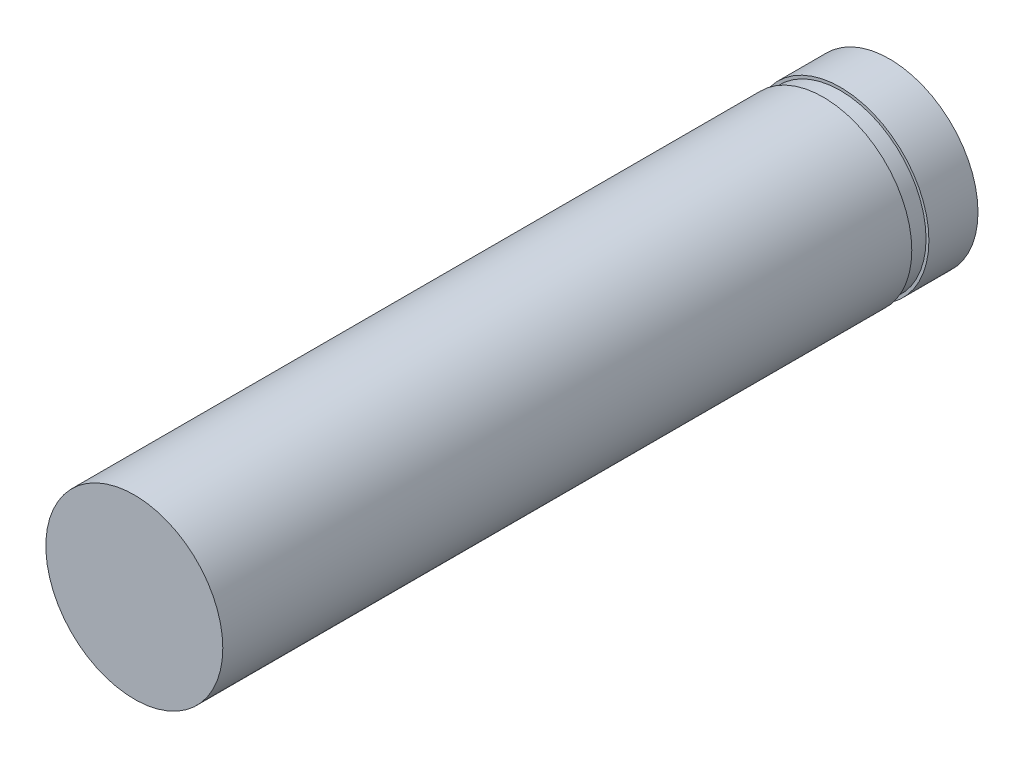
ISO-10303-21;
HEADER;
FILE_DESCRIPTION(('STEP AP214'),'2;1');
FILE_NAME('part.step','',(''),(''),'','','');
FILE_SCHEMA(('AUTOMOTIVE_DESIGN { 1 0 10303 214 1 1 1 1 }'));
ENDSEC;
DATA;
#1=APPLICATION_CONTEXT('core data for automotive mechanical design processes');
#2=APPLICATION_PROTOCOL_DEFINITION('international standard','automotive_design',2000,#1);
#3=PRODUCT_CONTEXT('',#1,'mechanical');
#4=PRODUCT('Part','Part','',(#3));
#5=PRODUCT_RELATED_PRODUCT_CATEGORY('part','',(#4));
#6=PRODUCT_DEFINITION_FORMATION('','',#4);
#7=PRODUCT_DEFINITION_CONTEXT('part definition',#1,'design');
#8=PRODUCT_DEFINITION('design','',#6,#7);
#9=PRODUCT_DEFINITION_SHAPE('','',#8);
#10=(LENGTH_UNIT() NAMED_UNIT(*) SI_UNIT(.MILLI.,.METRE.));
#11=(NAMED_UNIT(*) PLANE_ANGLE_UNIT() SI_UNIT($,.RADIAN.));
#12=(NAMED_UNIT(*) SI_UNIT($,.STERADIAN.) SOLID_ANGLE_UNIT());
#13=UNCERTAINTY_MEASURE_WITH_UNIT(LENGTH_MEASURE(1.E-05),#10,'distance_accuracy_value','');
#14=(GEOMETRIC_REPRESENTATION_CONTEXT(3) GLOBAL_UNCERTAINTY_ASSIGNED_CONTEXT((#13)) GLOBAL_UNIT_ASSIGNED_CONTEXT((#10,
#11,#12)) REPRESENTATION_CONTEXT('',''));
#15=CARTESIAN_POINT('',(0.,0.,0.));
#16=DIRECTION('',(0.,0.,1.));
#17=DIRECTION('',(1.,0.,0.));
#18=AXIS2_PLACEMENT_3D('',#15,#16,#17);
#19=CARTESIAN_POINT('',(0.,0.,-13.23));
#20=DIRECTION('',(0.,0.,1.));
#21=DIRECTION('',(1.,0.,0.));
#22=AXIS2_PLACEMENT_3D('',#19,#20,#21);
#23=CYLINDRICAL_SURFACE('',#22,1.55);
#24=CARTESIAN_POINT('',(0.,0.,-12.37));
#25=DIRECTION('',(0.,0.,1.));
#26=DIRECTION('',(1.,0.,0.));
#27=AXIS2_PLACEMENT_3D('',#24,#25,#26);
#28=CIRCLE('',#27,1.55);
#29=CARTESIAN_POINT('',(1.55,0.,-12.37));
#30=VERTEX_POINT('',#29);
#31=EDGE_CURVE('E41',#30,#30,#28,.T.);
#32=ORIENTED_EDGE('',*,*,#31,.F.);
#33=EDGE_LOOP('',(#32));
#34=FACE_BOUND('',#33,.T.);
#35=CARTESIAN_POINT('',(0.,0.,-13.23));
#36=DIRECTION('',(0.,0.,1.));
#37=DIRECTION('',(1.,0.,0.));
#38=AXIS2_PLACEMENT_3D('',#35,#36,#37);
#39=CIRCLE('',#38,1.55);
#40=CARTESIAN_POINT('',(1.55,0.,-13.23));
#41=VERTEX_POINT('',#40);
#42=EDGE_CURVE('E10',#41,#41,#39,.T.);
#43=ORIENTED_EDGE('',*,*,#42,.T.);
#44=EDGE_LOOP('',(#43));
#45=FACE_BOUND('',#44,.T.);
#46=ADVANCED_FACE('F30',(#34,#45),#23,.T.);
#47=CARTESIAN_POINT('',(0.,0.,-13.23));
#48=DIRECTION('',(0.,0.,1.));
#49=DIRECTION('',(1.,0.,0.));
#50=AXIS2_PLACEMENT_3D('',#47,#48,#49);
#51=PLANE('',#50);
#52=ORIENTED_EDGE('',*,*,#42,.F.);
#53=EDGE_LOOP('',(#52));
#54=FACE_BOUND('',#53,.T.);
#55=ADVANCED_FACE('F63',(#54),#51,.F.);
#56=CARTESIAN_POINT('',(1.5,0.,-12.37));
#57=DIRECTION('',(0.,0.,-1.));
#58=DIRECTION('',(-1.,0.,0.));
#59=AXIS2_PLACEMENT_3D('',#56,#57,#58);
#60=PLANE('',#59);
#61=CARTESIAN_POINT('',(0.,0.,-12.37));
#62=DIRECTION('',(0.,0.,1.));
#63=DIRECTION('',(1.,0.,0.));
#64=AXIS2_PLACEMENT_3D('',#61,#62,#63);
#65=CIRCLE('',#64,1.5);
#66=CARTESIAN_POINT('',(1.5,0.,-12.37));
#67=VERTEX_POINT('',#66);
#68=EDGE_CURVE('E53',#67,#67,#65,.T.);
#69=ORIENTED_EDGE('',*,*,#68,.F.);
#70=EDGE_LOOP('',(#69));
#71=FACE_BOUND('',#70,.T.);
#72=ORIENTED_EDGE('',*,*,#31,.T.);
#73=EDGE_LOOP('',(#72));
#74=FACE_BOUND('',#73,.T.);
#75=ADVANCED_FACE('F59',(#71,#74),#60,.F.);
#76=CARTESIAN_POINT('',(1.5,0.,-12.07));
#77=DIRECTION('',(0.,0.,1.));
#78=DIRECTION('',(1.,0.,0.));
#79=AXIS2_PLACEMENT_3D('',#76,#77,#78);
#80=PLANE('',#79);
#81=CARTESIAN_POINT('',(0.,0.,-12.07));
#82=DIRECTION('',(0.,0.,1.));
#83=DIRECTION('',(1.,0.,0.));
#84=AXIS2_PLACEMENT_3D('',#81,#82,#83);
#85=CIRCLE('',#84,1.55);
#86=CARTESIAN_POINT('',(1.55,0.,-12.07));
#87=VERTEX_POINT('',#86);
#88=EDGE_CURVE('E45',#87,#87,#85,.T.);
#89=ORIENTED_EDGE('',*,*,#88,.F.);
#90=EDGE_LOOP('',(#89));
#91=FACE_BOUND('',#90,.T.);
#92=CARTESIAN_POINT('',(0.,0.,-12.07));
#93=DIRECTION('',(0.,0.,1.));
#94=DIRECTION('',(1.,0.,0.));
#95=AXIS2_PLACEMENT_3D('',#92,#93,#94);
#96=CIRCLE('',#95,1.5);
#97=CARTESIAN_POINT('',(1.5,0.,-12.07));
#98=VERTEX_POINT('',#97);
#99=EDGE_CURVE('E50',#98,#98,#96,.T.);
#100=ORIENTED_EDGE('',*,*,#99,.T.);
#101=EDGE_LOOP('',(#100));
#102=FACE_BOUND('',#101,.T.);
#103=ADVANCED_FACE('F62',(#91,#102),#80,.F.);
#104=CARTESIAN_POINT('',(0.,0.,0.313071182548794));
#105=DIRECTION('',(0.,0.,1.));
#106=DIRECTION('',(1.,0.,0.));
#107=AXIS2_PLACEMENT_3D('',#104,#105,#106);
#108=CYLINDRICAL_SURFACE('',#107,1.5);
#109=ORIENTED_EDGE('',*,*,#99,.F.);
#110=EDGE_LOOP('',(#109));
#111=FACE_BOUND('',#110,.T.);
#112=ORIENTED_EDGE('',*,*,#68,.T.);
#113=EDGE_LOOP('',(#112));
#114=FACE_BOUND('',#113,.T.);
#115=ADVANCED_FACE('F57',(#111,#114),#108,.T.);
#116=CARTESIAN_POINT('',(0.,0.,0.));
#117=DIRECTION('',(0.,0.,1.));
#118=DIRECTION('',(1.,0.,0.));
#119=AXIS2_PLACEMENT_3D('',#116,#117,#118);
#120=PLANE('',#119);
#121=CARTESIAN_POINT('',(0.,0.,0.));
#122=DIRECTION('',(0.,0.,1.));
#123=DIRECTION('',(1.,0.,0.));
#124=AXIS2_PLACEMENT_3D('',#121,#122,#123);
#125=CIRCLE('',#124,1.55);
#126=CARTESIAN_POINT('',(1.55,0.,0.));
#127=VERTEX_POINT('',#126);
#128=EDGE_CURVE('E37',#127,#127,#125,.T.);
#129=ORIENTED_EDGE('',*,*,#128,.T.);
#130=EDGE_LOOP('',(#129));
#131=FACE_BOUND('',#130,.T.);
#132=ADVANCED_FACE('F73',(#131),#120,.T.);
#133=ORIENTED_EDGE('',*,*,#88,.T.);
#134=EDGE_LOOP('',(#133));
#135=FACE_BOUND('',#134,.T.);
#136=ORIENTED_EDGE('',*,*,#128,.F.);
#137=EDGE_LOOP('',(#136));
#138=FACE_BOUND('',#137,.T.);
#139=ADVANCED_FACE('F32',(#135,#138),#23,.T.);
#140=CLOSED_SHELL('',(#46,#55,#75,#103,#115,#132,#139));
#141=MANIFOLD_SOLID_BREP('B2',#140);
#142=ADVANCED_BREP_SHAPE_REPRESENTATION('',(#18,#141),#14);
#143=SHAPE_DEFINITION_REPRESENTATION(#9,#142);
ENDSEC;
END-ISO-10303-21;
